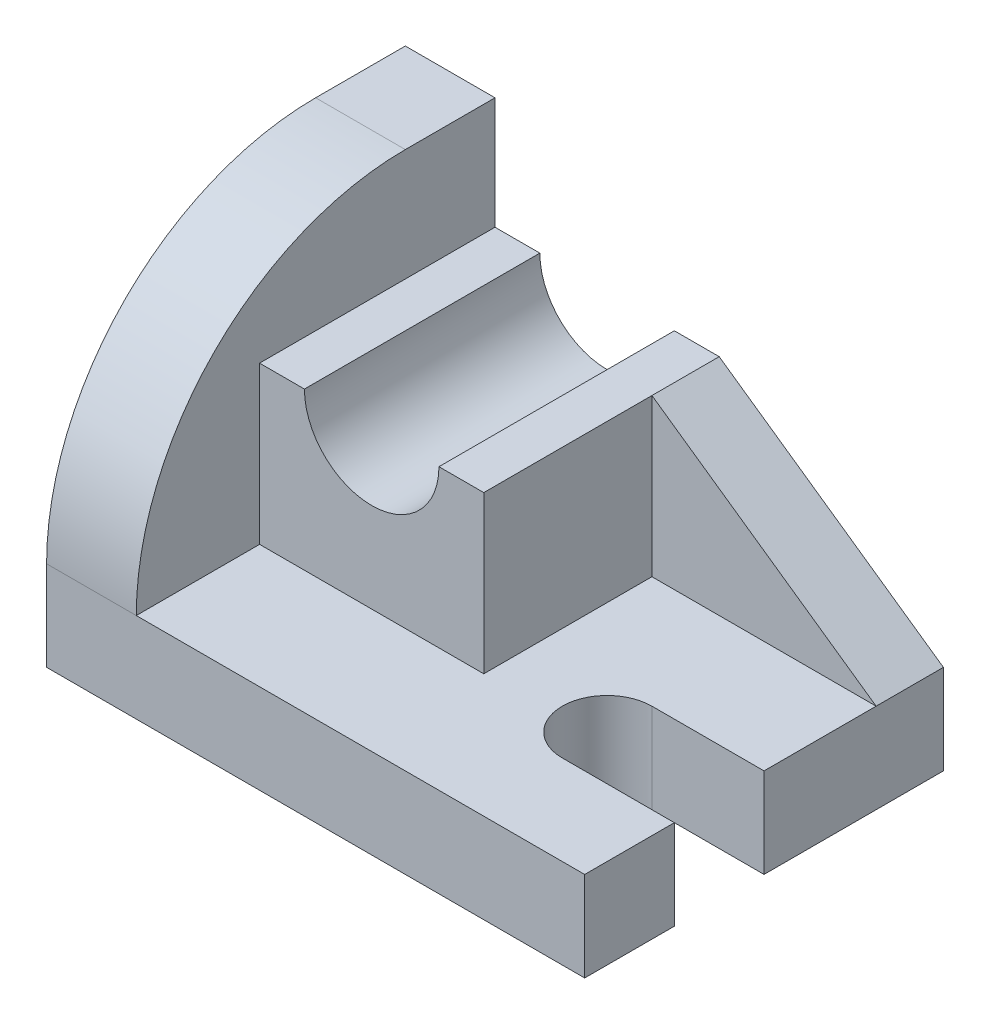
ISO-10303-21;
HEADER;
FILE_DESCRIPTION(('STEP AP214'),'2;1');
FILE_NAME('part.step','',(''),(''),'','','');
FILE_SCHEMA(('AUTOMOTIVE_DESIGN { 1 0 10303 214 1 1 1 1 }'));
ENDSEC;
DATA;
#1=APPLICATION_CONTEXT('core data for automotive mechanical design processes');
#2=APPLICATION_PROTOCOL_DEFINITION('international standard','automotive_design',2000,#1);
#3=PRODUCT_CONTEXT('',#1,'mechanical');
#4=PRODUCT('Part','Part','',(#3));
#5=PRODUCT_RELATED_PRODUCT_CATEGORY('part','',(#4));
#6=PRODUCT_DEFINITION_FORMATION('','',#4);
#7=PRODUCT_DEFINITION_CONTEXT('part definition',#1,'design');
#8=PRODUCT_DEFINITION('design','',#6,#7);
#9=PRODUCT_DEFINITION_SHAPE('','',#8);
#10=(LENGTH_UNIT() NAMED_UNIT(*) SI_UNIT(.MILLI.,.METRE.));
#11=(NAMED_UNIT(*) PLANE_ANGLE_UNIT() SI_UNIT($,.RADIAN.));
#12=(NAMED_UNIT(*) SI_UNIT($,.STERADIAN.) SOLID_ANGLE_UNIT());
#13=UNCERTAINTY_MEASURE_WITH_UNIT(LENGTH_MEASURE(1.E-05),#10,'distance_accuracy_value','');
#14=(GEOMETRIC_REPRESENTATION_CONTEXT(3) GLOBAL_UNCERTAINTY_ASSIGNED_CONTEXT((#13)) GLOBAL_UNIT_ASSIGNED_CONTEXT((#10,
#11,#12)) REPRESENTATION_CONTEXT('',''));
#15=CARTESIAN_POINT('',(0.,0.,0.));
#16=DIRECTION('',(0.,0.,1.));
#17=DIRECTION('',(1.,0.,0.));
#18=AXIS2_PLACEMENT_3D('',#15,#16,#17);
#19=CARTESIAN_POINT('',(0.,36.,0.));
#20=DIRECTION('',(0.,-1.,0.));
#21=DIRECTION('',(0.,0.,-1.));
#22=AXIS2_PLACEMENT_3D('',#19,#20,#21);
#23=PLANE('',#22);
#24=DIRECTION('',(-1.,0.,0.));
#25=VECTOR('',#24,1.);
#26=CARTESIAN_POINT('',(-40.,36.,-32.));
#27=LINE('',#26,#25);
#28=CARTESIAN_POINT('',(-40.,36.,-32.));
#29=VERTEX_POINT('',#28);
#30=CARTESIAN_POINT('',(-48.,36.,-32.));
#31=VERTEX_POINT('',#30);
#32=EDGE_CURVE('E172',#29,#31,#27,.T.);
#33=ORIENTED_EDGE('',*,*,#32,.T.);
#34=DIRECTION('',(0.,0.,1.));
#35=VECTOR('',#34,1.);
#36=CARTESIAN_POINT('',(-48.,36.,-32.));
#37=LINE('',#36,#35);
#38=CARTESIAN_POINT('',(-48.,36.,9.99999999999999));
#39=VERTEX_POINT('',#38);
#40=EDGE_CURVE('E157',#31,#39,#37,.T.);
#41=ORIENTED_EDGE('',*,*,#40,.T.);
#42=DIRECTION('',(1.,0.,0.));
#43=VECTOR('',#42,1.);
#44=CARTESIAN_POINT('',(-40.,36.,9.99999999999999));
#45=LINE('',#44,#43);
#46=CARTESIAN_POINT('',(-40.,36.,9.99999999999999));
#47=VERTEX_POINT('',#46);
#48=EDGE_CURVE('E187',#39,#47,#45,.T.);
#49=ORIENTED_EDGE('',*,*,#48,.T.);
#50=DIRECTION('',(0.,0.,-1.));
#51=VECTOR('',#50,1.);
#52=CARTESIAN_POINT('',(-40.,36.,-32.));
#53=LINE('',#52,#51);
#54=CARTESIAN_POINT('',(-40.,36.,-20.));
#55=VERTEX_POINT('',#54);
#56=EDGE_CURVE('E189',#47,#55,#53,.T.);
#57=ORIENTED_EDGE('',*,*,#56,.T.);
#58=DIRECTION('',(0.,0.,-1.));
#59=VECTOR('',#58,1.);
#60=CARTESIAN_POINT('',(-40.,36.,-20.));
#61=LINE('',#60,#59);
#62=EDGE_CURVE('E180',#55,#29,#61,.T.);
#63=ORIENTED_EDGE('',*,*,#62,.T.);
#64=EDGE_LOOP('',(#33,#41,#49,#57,#63));
#65=FACE_BOUND('',#64,.T.);
#66=ADVANCED_FACE('F43',(#65),#23,.F.);
#67=CARTESIAN_POINT('',(-96.,8.,32.));
#68=DIRECTION('',(0.,1.,0.));
#69=DIRECTION('',(0.,0.,1.));
#70=AXIS2_PLACEMENT_3D('',#67,#68,#69);
#71=PLANE('',#70);
#72=DIRECTION('',(1.,0.,0.));
#73=VECTOR('',#72,1.);
#74=CARTESIAN_POINT('',(-40.,8.,9.99999999999999));
#75=LINE('',#74,#73);
#76=CARTESIAN_POINT('',(-80.,8.,9.99999999999999));
#77=VERTEX_POINT('',#76);
#78=CARTESIAN_POINT('',(-40.,8.,9.99999999999999));
#79=VERTEX_POINT('',#78);
#80=EDGE_CURVE('E202',#77,#79,#75,.T.);
#81=ORIENTED_EDGE('',*,*,#80,.F.);
#82=DIRECTION('',(0.,0.,-1.));
#83=VECTOR('',#82,1.);
#84=CARTESIAN_POINT('',(-80.,8.,-32.));
#85=LINE('',#84,#83);
#86=CARTESIAN_POINT('',(-80.,8.,32.));
#87=VERTEX_POINT('',#86);
#88=EDGE_CURVE('E339',#87,#77,#85,.T.);
#89=ORIENTED_EDGE('',*,*,#88,.F.);
#90=DIRECTION('',(1.,0.,0.));
#91=VECTOR('',#90,1.);
#92=CARTESIAN_POINT('',(-96.,8.,32.));
#93=LINE('',#92,#91);
#94=CARTESIAN_POINT('',(0.,8.,32.));
#95=VERTEX_POINT('',#94);
#96=EDGE_CURVE('E280',#87,#95,#93,.T.);
#97=ORIENTED_EDGE('',*,*,#96,.T.);
#98=DIRECTION('',(0.,0.,1.));
#99=VECTOR('',#98,1.);
#100=CARTESIAN_POINT('',(0.,8.,32.));
#101=LINE('',#100,#99);
#102=CARTESIAN_POINT('',(0.,8.,16.));
#103=VERTEX_POINT('',#102);
#104=EDGE_CURVE('E284',#103,#95,#101,.T.);
#105=ORIENTED_EDGE('',*,*,#104,.F.);
#106=DIRECTION('',(1.,0.,0.));
#107=VECTOR('',#106,1.);
#108=CARTESIAN_POINT('',(0.,8.,16.));
#109=LINE('',#108,#107);
#110=CARTESIAN_POINT('',(-20.,8.,16.));
#111=VERTEX_POINT('',#110);
#112=EDGE_CURVE('E231',#111,#103,#109,.T.);
#113=ORIENTED_EDGE('',*,*,#112,.F.);
#114=CARTESIAN_POINT('',(-20.,8.,7.99999999999999));
#115=DIRECTION('',(0.,1.,0.));
#116=DIRECTION('',(0.,0.,-1.));
#117=AXIS2_PLACEMENT_3D('',#114,#115,#116);
#118=CIRCLE('',#117,8.);
#119=CARTESIAN_POINT('',(-20.,8.,0.));
#120=VERTEX_POINT('',#119);
#121=EDGE_CURVE('E237',#120,#111,#118,.T.);
#122=ORIENTED_EDGE('',*,*,#121,.F.);
#123=DIRECTION('',(-1.,0.,0.));
#124=VECTOR('',#123,1.);
#125=CARTESIAN_POINT('',(-20.,8.,0.));
#126=LINE('',#125,#124);
#127=CARTESIAN_POINT('',(0.,8.,0.));
#128=VERTEX_POINT('',#127);
#129=EDGE_CURVE('E248',#128,#120,#126,.T.);
#130=ORIENTED_EDGE('',*,*,#129,.F.);
#131=CARTESIAN_POINT('',(0.,8.,-20.));
#132=VERTEX_POINT('',#131);
#133=EDGE_CURVE('E290',#132,#128,#101,.T.);
#134=ORIENTED_EDGE('',*,*,#133,.F.);
#135=DIRECTION('',(-1.,0.,0.));
#136=VECTOR('',#135,1.);
#137=CARTESIAN_POINT('',(0.,8.,-20.));
#138=LINE('',#137,#136);
#139=CARTESIAN_POINT('',(-40.,8.00000000000001,-20.));
#140=VERTEX_POINT('',#139);
#141=EDGE_CURVE('E219',#132,#140,#138,.T.);
#142=ORIENTED_EDGE('',*,*,#141,.T.);
#143=DIRECTION('',(0.,0.,-1.));
#144=VECTOR('',#143,1.);
#145=CARTESIAN_POINT('',(-40.,8.,-32.));
#146=LINE('',#145,#144);
#147=EDGE_CURVE('E198',#79,#140,#146,.T.);
#148=ORIENTED_EDGE('',*,*,#147,.F.);
#149=EDGE_LOOP('',(#81,#89,#97,#105,#113,#122,#130,#134,#142,#148));
#150=FACE_BOUND('',#149,.T.);
#151=ADVANCED_FACE('F367',(#150),#71,.T.);
#152=CARTESIAN_POINT('',(0.,0.,0.));
#153=DIRECTION('',(1.,0.,0.));
#154=DIRECTION('',(0.,0.,-1.));
#155=AXIS2_PLACEMENT_3D('',#152,#153,#154);
#156=PLANE('',#155);
#157=DIRECTION('',(0.,1.,0.));
#158=VECTOR('',#157,1.);
#159=CARTESIAN_POINT('',(0.,-8.,16.));
#160=LINE('',#159,#158);
#161=CARTESIAN_POINT('',(0.,-8.,16.));
#162=VERTEX_POINT('',#161);
#163=EDGE_CURVE('E245',#162,#103,#160,.T.);
#164=ORIENTED_EDGE('',*,*,#163,.T.);
#165=ORIENTED_EDGE('',*,*,#104,.T.);
#166=DIRECTION('',(0.,-1.,0.));
#167=VECTOR('',#166,1.);
#168=CARTESIAN_POINT('',(0.,8.,32.));
#169=LINE('',#168,#167);
#170=CARTESIAN_POINT('',(0.,-8.,32.));
#171=VERTEX_POINT('',#170);
#172=EDGE_CURVE('E289',#95,#171,#169,.T.);
#173=ORIENTED_EDGE('',*,*,#172,.T.);
#174=DIRECTION('',(0.,0.,-1.));
#175=VECTOR('',#174,1.);
#176=CARTESIAN_POINT('',(0.,-8.,32.));
#177=LINE('',#176,#175);
#178=EDGE_CURVE('E273',#171,#162,#177,.T.);
#179=ORIENTED_EDGE('',*,*,#178,.T.);
#180=EDGE_LOOP('',(#164,#165,#173,#179));
#181=FACE_BOUND('',#180,.T.);
#182=ADVANCED_FACE('F374',(#181),#156,.T.);
#183=CARTESIAN_POINT('',(-96.,8.,-32.));
#184=DIRECTION('',(0.,0.,-1.));
#185=DIRECTION('',(-1.,0.,0.));
#186=AXIS2_PLACEMENT_3D('',#183,#184,#185);
#187=PLANE('',#186);
#188=CARTESIAN_POINT('',(-60.,36.,-32.));
#189=DIRECTION('',(0.,0.,1.));
#190=DIRECTION('',(1.,0.,0.));
#191=AXIS2_PLACEMENT_3D('',#188,#189,#190);
#192=CIRCLE('',#191,12.);
#193=CARTESIAN_POINT('',(-72.,36.,-32.));
#194=VERTEX_POINT('',#193);
#195=EDGE_CURVE('E59',#194,#31,#192,.T.);
#196=ORIENTED_EDGE('',*,*,#195,.T.);
#197=ORIENTED_EDGE('',*,*,#32,.F.);
#198=DIRECTION('',(0.81923192051904,-0.573462344363328,0.));
#199=VECTOR('',#198,1.);
#200=CARTESIAN_POINT('',(-40.,36.,-32.));
#201=LINE('',#200,#199);
#202=CARTESIAN_POINT('',(0.,8.,-32.));
#203=VERTEX_POINT('',#202);
#204=EDGE_CURVE('E214',#29,#203,#201,.T.);
#205=ORIENTED_EDGE('',*,*,#204,.T.);
#206=DIRECTION('',(0.,1.,0.));
#207=VECTOR('',#206,1.);
#208=CARTESIAN_POINT('',(0.,8.,-32.));
#209=LINE('',#208,#207);
#210=CARTESIAN_POINT('',(0.,-8.,-32.));
#211=VERTEX_POINT('',#210);
#212=EDGE_CURVE('E258',#211,#203,#209,.T.);
#213=ORIENTED_EDGE('',*,*,#212,.F.);
#214=DIRECTION('',(1.,0.,0.));
#215=VECTOR('',#214,1.);
#216=CARTESIAN_POINT('',(-96.,-8.,-32.));
#217=LINE('',#216,#215);
#218=CARTESIAN_POINT('',(-96.,-8.,-32.));
#219=VERTEX_POINT('',#218);
#220=EDGE_CURVE('E298',#219,#211,#217,.T.);
#221=ORIENTED_EDGE('',*,*,#220,.F.);
#222=DIRECTION('',(0.,1.,0.));
#223=VECTOR('',#222,1.);
#224=CARTESIAN_POINT('',(-96.,8.,-32.));
#225=LINE('',#224,#223);
#226=CARTESIAN_POINT('',(-96.,56.,-32.));
#227=VERTEX_POINT('',#226);
#228=EDGE_CURVE('E269',#219,#227,#225,.T.);
#229=ORIENTED_EDGE('',*,*,#228,.T.);
#230=DIRECTION('',(-1.,0.,0.));
#231=VECTOR('',#230,1.);
#232=CARTESIAN_POINT('',(-96.,56.,-32.));
#233=LINE('',#232,#231);
#234=CARTESIAN_POINT('',(-80.,56.,-32.));
#235=VERTEX_POINT('',#234);
#236=EDGE_CURVE('E329',#235,#227,#233,.T.);
#237=ORIENTED_EDGE('',*,*,#236,.F.);
#238=DIRECTION('',(0.,-1.,0.));
#239=VECTOR('',#238,1.);
#240=CARTESIAN_POINT('',(-80.,56.,-32.));
#241=LINE('',#240,#239);
#242=CARTESIAN_POINT('',(-80.,36.,-32.));
#243=VERTEX_POINT('',#242);
#244=EDGE_CURVE('E203',#235,#243,#241,.T.);
#245=ORIENTED_EDGE('',*,*,#244,.T.);
#246=EDGE_CURVE('E174',#194,#243,#27,.T.);
#247=ORIENTED_EDGE('',*,*,#246,.F.);
#248=EDGE_LOOP('',(#196,#197,#205,#213,#221,#229,#237,#245,#247));
#249=FACE_BOUND('',#248,.T.);
#250=ADVANCED_FACE('F170',(#249),#187,.T.);
#251=CARTESIAN_POINT('',(-96.,-8.,32.));
#252=DIRECTION('',(0.,-1.,0.));
#253=DIRECTION('',(0.,0.,-1.));
#254=AXIS2_PLACEMENT_3D('',#251,#252,#253);
#255=PLANE('',#254);
#256=DIRECTION('',(1.,0.,0.));
#257=VECTOR('',#256,1.);
#258=CARTESIAN_POINT('',(0.,-8.,16.));
#259=LINE('',#258,#257);
#260=CARTESIAN_POINT('',(-20.,-8.,16.));
#261=VERTEX_POINT('',#260);
#262=EDGE_CURVE('E232',#261,#162,#259,.T.);
#263=ORIENTED_EDGE('',*,*,#262,.T.);
#264=ORIENTED_EDGE('',*,*,#178,.F.);
#265=DIRECTION('',(1.,0.,0.));
#266=VECTOR('',#265,1.);
#267=CARTESIAN_POINT('',(-96.,-8.,32.));
#268=LINE('',#267,#266);
#269=CARTESIAN_POINT('',(-96.,-8.,32.));
#270=VERTEX_POINT('',#269);
#271=EDGE_CURVE('E303',#270,#171,#268,.T.);
#272=ORIENTED_EDGE('',*,*,#271,.F.);
#273=DIRECTION('',(0.,0.,-1.));
#274=VECTOR('',#273,1.);
#275=CARTESIAN_POINT('',(-96.,-8.,32.));
#276=LINE('',#275,#274);
#277=EDGE_CURVE('E276',#270,#219,#276,.T.);
#278=ORIENTED_EDGE('',*,*,#277,.T.);
#279=ORIENTED_EDGE('',*,*,#220,.T.);
#280=CARTESIAN_POINT('',(0.,-8.,0.));
#281=VERTEX_POINT('',#280);
#282=EDGE_CURVE('E294',#281,#211,#177,.T.);
#283=ORIENTED_EDGE('',*,*,#282,.F.);
#284=DIRECTION('',(-1.,0.,0.));
#285=VECTOR('',#284,1.);
#286=CARTESIAN_POINT('',(-20.,-8.,0.));
#287=LINE('',#286,#285);
#288=CARTESIAN_POINT('',(-20.,-8.,0.));
#289=VERTEX_POINT('',#288);
#290=EDGE_CURVE('E236',#281,#289,#287,.T.);
#291=ORIENTED_EDGE('',*,*,#290,.T.);
#292=CARTESIAN_POINT('',(-20.,-8.,7.99999999999999));
#293=DIRECTION('',(0.,1.,0.));
#294=DIRECTION('',(0.,0.,-1.));
#295=AXIS2_PLACEMENT_3D('',#292,#293,#294);
#296=CIRCLE('',#295,8.);
#297=EDGE_CURVE('E241',#289,#261,#296,.T.);
#298=ORIENTED_EDGE('',*,*,#297,.T.);
#299=EDGE_LOOP('',(#263,#264,#272,#278,#279,#283,#291,#298));
#300=FACE_BOUND('',#299,.T.);
#301=ADVANCED_FACE('F376',(#300),#255,.T.);
#302=CARTESIAN_POINT('',(-96.,8.,32.));
#303=DIRECTION('',(0.,0.,1.));
#304=DIRECTION('',(1.,0.,0.));
#305=AXIS2_PLACEMENT_3D('',#302,#303,#304);
#306=PLANE('',#305);
#307=ORIENTED_EDGE('',*,*,#96,.F.);
#308=DIRECTION('',(1.,0.,0.));
#309=VECTOR('',#308,1.);
#310=CARTESIAN_POINT('',(-96.,8.,32.));
#311=LINE('',#310,#309);
#312=CARTESIAN_POINT('',(-96.,8.,32.));
#313=VERTEX_POINT('',#312);
#314=EDGE_CURVE('E52',#87,#313,#311,.F.);
#315=ORIENTED_EDGE('',*,*,#314,.T.);
#316=DIRECTION('',(0.,-1.,0.));
#317=VECTOR('',#316,1.);
#318=CARTESIAN_POINT('',(-96.,8.,32.));
#319=LINE('',#318,#317);
#320=EDGE_CURVE('E272',#313,#270,#319,.T.);
#321=ORIENTED_EDGE('',*,*,#320,.T.);
#322=ORIENTED_EDGE('',*,*,#271,.T.);
#323=ORIENTED_EDGE('',*,*,#172,.F.);
#324=EDGE_LOOP('',(#307,#315,#321,#322,#323));
#325=FACE_BOUND('',#324,.T.);
#326=ADVANCED_FACE('F370',(#325),#306,.T.);
#327=CARTESIAN_POINT('',(-96.,0.,0.));
#328=DIRECTION('',(1.,0.,0.));
#329=DIRECTION('',(0.,0.,-1.));
#330=AXIS2_PLACEMENT_3D('',#327,#328,#329);
#331=PLANE('',#330);
#332=ORIENTED_EDGE('',*,*,#320,.F.);
#333=CARTESIAN_POINT('',(-96.,8.,-16.));
#334=DIRECTION('',(1.,0.,0.));
#335=DIRECTION('',(0.,0.,-1.));
#336=AXIS2_PLACEMENT_3D('',#333,#334,#335);
#337=CIRCLE('',#336,48.);
#338=CARTESIAN_POINT('',(-96.,56.,-16.));
#339=VERTEX_POINT('',#338);
#340=EDGE_CURVE('E11',#313,#339,#337,.F.);
#341=ORIENTED_EDGE('',*,*,#340,.T.);
#342=DIRECTION('',(0.,0.,1.));
#343=VECTOR('',#342,1.);
#344=CARTESIAN_POINT('',(-96.,56.,-32.));
#345=LINE('',#344,#343);
#346=EDGE_CURVE('E335',#227,#339,#345,.T.);
#347=ORIENTED_EDGE('',*,*,#346,.F.);
#348=ORIENTED_EDGE('',*,*,#228,.F.);
#349=ORIENTED_EDGE('',*,*,#277,.F.);
#350=EDGE_LOOP('',(#332,#341,#347,#348,#349));
#351=FACE_BOUND('',#350,.T.);
#352=ADVANCED_FACE('F361',(#351),#331,.F.);
#353=DIRECTION('',(0.,1.,0.));
#354=VECTOR('',#353,1.);
#355=CARTESIAN_POINT('',(0.,-8.,0.));
#356=LINE('',#355,#354);
#357=EDGE_CURVE('E262',#281,#128,#356,.T.);
#358=ORIENTED_EDGE('',*,*,#357,.F.);
#359=ORIENTED_EDGE('',*,*,#282,.T.);
#360=ORIENTED_EDGE('',*,*,#212,.T.);
#361=EDGE_CURVE('E285',#203,#132,#101,.T.);
#362=ORIENTED_EDGE('',*,*,#361,.T.);
#363=ORIENTED_EDGE('',*,*,#133,.T.);
#364=EDGE_LOOP('',(#358,#359,#360,#362,#363));
#365=FACE_BOUND('',#364,.T.);
#366=ADVANCED_FACE('F392',(#365),#156,.T.);
#367=CARTESIAN_POINT('',(0.,-8.,16.));
#368=DIRECTION('',(0.,0.,1.));
#369=DIRECTION('',(1.,0.,0.));
#370=AXIS2_PLACEMENT_3D('',#367,#368,#369);
#371=PLANE('',#370);
#372=ORIENTED_EDGE('',*,*,#112,.T.);
#373=ORIENTED_EDGE('',*,*,#163,.F.);
#374=ORIENTED_EDGE('',*,*,#262,.F.);
#375=DIRECTION('',(0.,1.,0.));
#376=VECTOR('',#375,1.);
#377=CARTESIAN_POINT('',(-20.,-8.,16.));
#378=LINE('',#377,#376);
#379=EDGE_CURVE('E255',#261,#111,#378,.T.);
#380=ORIENTED_EDGE('',*,*,#379,.T.);
#381=EDGE_LOOP('',(#372,#373,#374,#380));
#382=FACE_BOUND('',#381,.T.);
#383=ADVANCED_FACE('F380',(#382),#371,.F.);
#384=CARTESIAN_POINT('',(-20.,-8.,7.99999999999999));
#385=DIRECTION('',(0.,1.,0.));
#386=DIRECTION('',(0.,0.,1.));
#387=AXIS2_PLACEMENT_3D('',#384,#385,#386);
#388=CYLINDRICAL_SURFACE('',#387,8.);
#389=ORIENTED_EDGE('',*,*,#121,.T.);
#390=ORIENTED_EDGE('',*,*,#379,.F.);
#391=ORIENTED_EDGE('',*,*,#297,.F.);
#392=DIRECTION('',(0.,1.,0.));
#393=VECTOR('',#392,1.);
#394=CARTESIAN_POINT('',(-20.,-8.,0.));
#395=LINE('',#394,#393);
#396=EDGE_CURVE('E259',#289,#120,#395,.T.);
#397=ORIENTED_EDGE('',*,*,#396,.T.);
#398=EDGE_LOOP('',(#389,#390,#391,#397));
#399=FACE_BOUND('',#398,.T.);
#400=ADVANCED_FACE('F386',(#399),#388,.F.);
#401=CARTESIAN_POINT('',(-20.,-8.,0.));
#402=DIRECTION('',(0.,0.,-1.));
#403=DIRECTION('',(-1.,0.,0.));
#404=AXIS2_PLACEMENT_3D('',#401,#402,#403);
#405=PLANE('',#404);
#406=ORIENTED_EDGE('',*,*,#129,.T.);
#407=ORIENTED_EDGE('',*,*,#396,.F.);
#408=ORIENTED_EDGE('',*,*,#290,.F.);
#409=ORIENTED_EDGE('',*,*,#357,.T.);
#410=EDGE_LOOP('',(#406,#407,#408,#409));
#411=FACE_BOUND('',#410,.T.);
#412=ADVANCED_FACE('F388',(#411),#405,.F.);
#413=CARTESIAN_POINT('',(-40.,36.,-20.));
#414=DIRECTION('',(0.573462344363328,0.81923192051904,0.));
#415=DIRECTION('',(-0.81923192051904,0.573462344363328,0.));
#416=AXIS2_PLACEMENT_3D('',#413,#414,#415);
#417=PLANE('',#416);
#418=ORIENTED_EDGE('',*,*,#204,.F.);
#419=ORIENTED_EDGE('',*,*,#62,.F.);
#420=DIRECTION('',(0.81923192051904,-0.573462344363328,0.));
#421=VECTOR('',#420,1.);
#422=CARTESIAN_POINT('',(-40.,36.,-20.));
#423=LINE('',#422,#421);
#424=EDGE_CURVE('E215',#55,#132,#423,.T.);
#425=ORIENTED_EDGE('',*,*,#424,.T.);
#426=ORIENTED_EDGE('',*,*,#361,.F.);
#427=EDGE_LOOP('',(#418,#419,#425,#426));
#428=FACE_BOUND('',#427,.T.);
#429=ADVANCED_FACE('F395',(#428),#417,.T.);
#430=CARTESIAN_POINT('',(0.,0.,-20.));
#431=DIRECTION('',(0.,0.,1.));
#432=DIRECTION('',(1.,0.,0.));
#433=AXIS2_PLACEMENT_3D('',#430,#431,#432);
#434=PLANE('',#433);
#435=ORIENTED_EDGE('',*,*,#424,.F.);
#436=DIRECTION('',(0.,1.,0.));
#437=VECTOR('',#436,1.);
#438=CARTESIAN_POINT('',(-40.,8.00000000000001,-20.));
#439=LINE('',#438,#437);
#440=EDGE_CURVE('E223',#140,#55,#439,.T.);
#441=ORIENTED_EDGE('',*,*,#440,.F.);
#442=ORIENTED_EDGE('',*,*,#141,.F.);
#443=EDGE_LOOP('',(#435,#441,#442));
#444=FACE_BOUND('',#443,.T.);
#445=ADVANCED_FACE('F397',(#444),#434,.T.);
#446=CARTESIAN_POINT('',(-40.,36.,-32.));
#447=DIRECTION('',(-1.,0.,0.));
#448=DIRECTION('',(0.,0.,1.));
#449=AXIS2_PLACEMENT_3D('',#446,#447,#448);
#450=PLANE('',#449);
#451=ORIENTED_EDGE('',*,*,#440,.T.);
#452=ORIENTED_EDGE('',*,*,#56,.F.);
#453=DIRECTION('',(0.,-1.,0.));
#454=VECTOR('',#453,1.);
#455=CARTESIAN_POINT('',(-40.,36.,9.99999999999999));
#456=LINE('',#455,#454);
#457=EDGE_CURVE('E197',#47,#79,#456,.T.);
#458=ORIENTED_EDGE('',*,*,#457,.T.);
#459=ORIENTED_EDGE('',*,*,#147,.T.);
#460=EDGE_LOOP('',(#451,#452,#458,#459));
#461=FACE_BOUND('',#460,.T.);
#462=ADVANCED_FACE('F325',(#461),#450,.F.);
#463=CARTESIAN_POINT('',(-40.,36.,9.99999999999999));
#464=DIRECTION('',(0.,0.,-1.));
#465=DIRECTION('',(-1.,0.,0.));
#466=AXIS2_PLACEMENT_3D('',#463,#464,#465);
#467=PLANE('',#466);
#468=ORIENTED_EDGE('',*,*,#48,.F.);
#469=CARTESIAN_POINT('',(-60.,36.,9.99999999999999));
#470=DIRECTION('',(0.,0.,1.));
#471=DIRECTION('',(1.,0.,0.));
#472=AXIS2_PLACEMENT_3D('',#469,#470,#471);
#473=CIRCLE('',#472,12.);
#474=CARTESIAN_POINT('',(-72.,36.,9.99999999999999));
#475=VERTEX_POINT('',#474);
#476=EDGE_CURVE('E160',#475,#39,#473,.T.);
#477=ORIENTED_EDGE('',*,*,#476,.F.);
#478=CARTESIAN_POINT('',(-80.,36.,10.));
#479=VERTEX_POINT('',#478);
#480=EDGE_CURVE('E193',#479,#475,#45,.T.);
#481=ORIENTED_EDGE('',*,*,#480,.F.);
#482=DIRECTION('',(0.,-1.,0.));
#483=VECTOR('',#482,1.);
#484=CARTESIAN_POINT('',(-80.,36.,10.));
#485=LINE('',#484,#483);
#486=EDGE_CURVE('E210',#479,#77,#485,.T.);
#487=ORIENTED_EDGE('',*,*,#486,.T.);
#488=ORIENTED_EDGE('',*,*,#80,.T.);
#489=ORIENTED_EDGE('',*,*,#457,.F.);
#490=EDGE_LOOP('',(#468,#477,#481,#487,#488,#489));
#491=FACE_BOUND('',#490,.T.);
#492=ADVANCED_FACE('F322',(#491),#467,.F.);
#493=ORIENTED_EDGE('',*,*,#480,.T.);
#494=DIRECTION('',(0.,0.,1.));
#495=VECTOR('',#494,1.);
#496=CARTESIAN_POINT('',(-72.,36.,-32.));
#497=LINE('',#496,#495);
#498=EDGE_CURVE('E165',#194,#475,#497,.T.);
#499=ORIENTED_EDGE('',*,*,#498,.F.);
#500=ORIENTED_EDGE('',*,*,#246,.T.);
#501=DIRECTION('',(0.,0.,1.));
#502=VECTOR('',#501,1.);
#503=CARTESIAN_POINT('',(-80.,36.,-32.));
#504=LINE('',#503,#502);
#505=EDGE_CURVE('E182',#243,#479,#504,.T.);
#506=ORIENTED_EDGE('',*,*,#505,.T.);
#507=EDGE_LOOP('',(#493,#499,#500,#506));
#508=FACE_BOUND('',#507,.T.);
#509=ADVANCED_FACE('F348',(#508),#23,.F.);
#510=CARTESIAN_POINT('',(-80.,56.,-32.));
#511=DIRECTION('',(-1.,0.,0.));
#512=DIRECTION('',(0.,0.,1.));
#513=AXIS2_PLACEMENT_3D('',#510,#511,#512);
#514=PLANE('',#513);
#515=DIRECTION('',(0.,0.,-1.));
#516=VECTOR('',#515,1.);
#517=CARTESIAN_POINT('',(-80.,56.,-32.));
#518=LINE('',#517,#516);
#519=CARTESIAN_POINT('',(-80.,56.,-16.));
#520=VERTEX_POINT('',#519);
#521=EDGE_CURVE('E332',#520,#235,#518,.T.);
#522=ORIENTED_EDGE('',*,*,#521,.F.);
#523=CARTESIAN_POINT('',(-80.,8.,-16.));
#524=DIRECTION('',(-1.,0.,0.));
#525=DIRECTION('',(0.,0.,1.));
#526=AXIS2_PLACEMENT_3D('',#523,#524,#525);
#527=CIRCLE('',#526,48.);
#528=EDGE_CURVE('E311',#520,#87,#527,.F.);
#529=ORIENTED_EDGE('',*,*,#528,.T.);
#530=ORIENTED_EDGE('',*,*,#88,.T.);
#531=ORIENTED_EDGE('',*,*,#486,.F.);
#532=ORIENTED_EDGE('',*,*,#505,.F.);
#533=ORIENTED_EDGE('',*,*,#244,.F.);
#534=EDGE_LOOP('',(#522,#529,#530,#531,#532,#533));
#535=FACE_BOUND('',#534,.T.);
#536=ADVANCED_FACE('F353',(#535),#514,.F.);
#537=CARTESIAN_POINT('',(0.,56.,0.));
#538=DIRECTION('',(0.,1.,0.));
#539=DIRECTION('',(0.,0.,1.));
#540=AXIS2_PLACEMENT_3D('',#537,#538,#539);
#541=PLANE('',#540);
#542=ORIENTED_EDGE('',*,*,#346,.T.);
#543=DIRECTION('',(1.,0.,0.));
#544=VECTOR('',#543,1.);
#545=CARTESIAN_POINT('',(0.,56.,-16.));
#546=LINE('',#545,#544);
#547=EDGE_CURVE('E302',#339,#520,#546,.T.);
#548=ORIENTED_EDGE('',*,*,#547,.T.);
#549=ORIENTED_EDGE('',*,*,#521,.T.);
#550=ORIENTED_EDGE('',*,*,#236,.T.);
#551=EDGE_LOOP('',(#542,#548,#549,#550));
#552=FACE_BOUND('',#551,.T.);
#553=ADVANCED_FACE('F358',(#552),#541,.T.);
#554=CARTESIAN_POINT('',(0.,8.,-16.));
#555=DIRECTION('',(1.,0.,0.));
#556=DIRECTION('',(0.,0.,-1.));
#557=AXIS2_PLACEMENT_3D('',#554,#555,#556);
#558=CYLINDRICAL_SURFACE('',#557,48.);
#559=ORIENTED_EDGE('',*,*,#340,.F.);
#560=ORIENTED_EDGE('',*,*,#314,.F.);
#561=ORIENTED_EDGE('',*,*,#528,.F.);
#562=ORIENTED_EDGE('',*,*,#547,.F.);
#563=EDGE_LOOP('',(#559,#560,#561,#562));
#564=FACE_BOUND('',#563,.T.);
#565=ADVANCED_FACE('F45',(#564),#558,.T.);
#566=CARTESIAN_POINT('',(-60.,36.,-32.));
#567=DIRECTION('',(0.,0.,1.));
#568=DIRECTION('',(1.,0.,0.));
#569=AXIS2_PLACEMENT_3D('',#566,#567,#568);
#570=CYLINDRICAL_SURFACE('',#569,12.);
#571=ORIENTED_EDGE('',*,*,#476,.T.);
#572=ORIENTED_EDGE('',*,*,#40,.F.);
#573=ORIENTED_EDGE('',*,*,#195,.F.);
#574=ORIENTED_EDGE('',*,*,#498,.T.);
#575=EDGE_LOOP('',(#571,#572,#573,#574));
#576=FACE_BOUND('',#575,.T.);
#577=ADVANCED_FACE('F158',(#576),#570,.F.);
#578=CLOSED_SHELL('',(#66,#151,#182,#250,#301,#326,#352,#366,#383,#400,#412,#429,#445,#462,#492,
#509,#536,#553,#565,#577));
#579=MANIFOLD_SOLID_BREP('B2',#578);
#580=ADVANCED_BREP_SHAPE_REPRESENTATION('',(#18,#579),#14);
#581=SHAPE_DEFINITION_REPRESENTATION(#9,#580);
ENDSEC;
END-ISO-10303-21;
